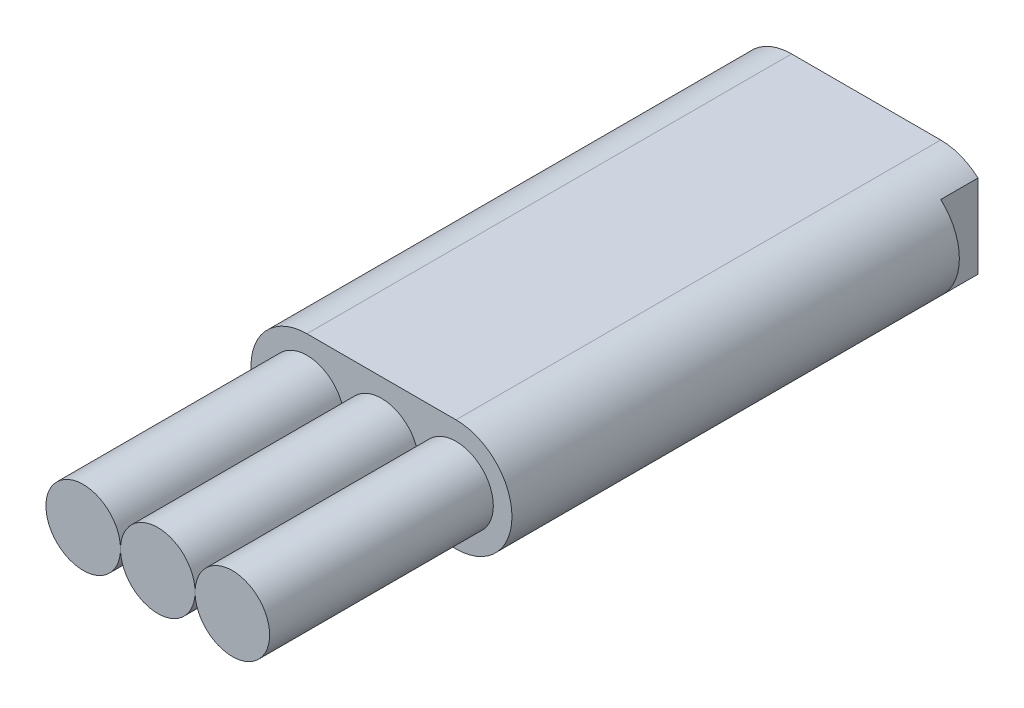
ISO-10303-21;
HEADER;
FILE_DESCRIPTION(('STEP AP214'),'2;1');
FILE_NAME('part.step','',(''),(''),'','','');
FILE_SCHEMA(('AUTOMOTIVE_DESIGN { 1 0 10303 214 1 1 1 1 }'));
ENDSEC;
DATA;
#1=APPLICATION_CONTEXT('core data for automotive mechanical design processes');
#2=APPLICATION_PROTOCOL_DEFINITION('international standard','automotive_design',2000,#1);
#3=PRODUCT_CONTEXT('',#1,'mechanical');
#4=PRODUCT('Part','Part','',(#3));
#5=PRODUCT_RELATED_PRODUCT_CATEGORY('part','',(#4));
#6=PRODUCT_DEFINITION_FORMATION('','',#4);
#7=PRODUCT_DEFINITION_CONTEXT('part definition',#1,'design');
#8=PRODUCT_DEFINITION('design','',#6,#7);
#9=PRODUCT_DEFINITION_SHAPE('','',#8);
#10=(LENGTH_UNIT() NAMED_UNIT(*) SI_UNIT(.MILLI.,.METRE.));
#11=(NAMED_UNIT(*) PLANE_ANGLE_UNIT() SI_UNIT($,.RADIAN.));
#12=(NAMED_UNIT(*) SI_UNIT($,.STERADIAN.) SOLID_ANGLE_UNIT());
#13=UNCERTAINTY_MEASURE_WITH_UNIT(LENGTH_MEASURE(1.E-05),#10,'distance_accuracy_value','');
#14=(GEOMETRIC_REPRESENTATION_CONTEXT(3) GLOBAL_UNCERTAINTY_ASSIGNED_CONTEXT((#13)) GLOBAL_UNIT_ASSIGNED_CONTEXT((#10,
#11,#12)) REPRESENTATION_CONTEXT('',''));
#15=CARTESIAN_POINT('',(0.,0.,0.));
#16=DIRECTION('',(0.,0.,1.));
#17=DIRECTION('',(1.,0.,0.));
#18=AXIS2_PLACEMENT_3D('',#15,#16,#17);
#19=CARTESIAN_POINT('',(2.,0.,-13.));
#20=DIRECTION('',(0.,0.,1.));
#21=DIRECTION('',(1.,0.,0.));
#22=AXIS2_PLACEMENT_3D('',#19,#20,#21);
#23=CYLINDRICAL_SURFACE('',#22,1.5);
#24=CARTESIAN_POINT('',(2.,0.,-13.));
#25=DIRECTION('',(0.,0.,-1.));
#26=DIRECTION('',(-1.,0.,0.));
#27=AXIS2_PLACEMENT_3D('',#24,#25,#26);
#28=CIRCLE('',#27,1.5);
#29=CARTESIAN_POINT('',(3.,-1.11803398874989,-13.));
#30=VERTEX_POINT('',#29);
#31=CARTESIAN_POINT('',(2.,-1.5,-13.));
#32=VERTEX_POINT('',#31);
#33=EDGE_CURVE('E137',#30,#32,#28,.T.);
#34=ORIENTED_EDGE('',*,*,#33,.F.);
#35=DIRECTION('',(0.,0.,1.));
#36=VECTOR('',#35,1.);
#37=CARTESIAN_POINT('',(3.,-1.11803398874989,-13.));
#38=LINE('',#37,#36);
#39=CARTESIAN_POINT('',(3.,-1.11803398874989,-12.));
#40=VERTEX_POINT('',#39);
#41=EDGE_CURVE('E69',#30,#40,#38,.T.);
#42=ORIENTED_EDGE('',*,*,#41,.T.);
#43=CARTESIAN_POINT('',(2.,0.,-12.));
#44=DIRECTION('',(0.,0.,1.));
#45=DIRECTION('',(1.,0.,0.));
#46=AXIS2_PLACEMENT_3D('',#43,#44,#45);
#47=CIRCLE('',#46,1.5);
#48=CARTESIAN_POINT('',(3.,1.11803398874989,-12.));
#49=VERTEX_POINT('',#48);
#50=EDGE_CURVE('E13',#40,#49,#47,.T.);
#51=ORIENTED_EDGE('',*,*,#50,.T.);
#52=DIRECTION('',(0.,0.,1.));
#53=VECTOR('',#52,1.);
#54=CARTESIAN_POINT('',(3.,1.11803398874989,-13.));
#55=LINE('',#54,#53);
#56=CARTESIAN_POINT('',(3.,1.11803398874989,-13.));
#57=VERTEX_POINT('',#56);
#58=EDGE_CURVE('E120',#49,#57,#55,.F.);
#59=ORIENTED_EDGE('',*,*,#58,.T.);
#60=CARTESIAN_POINT('',(2.,1.5,-13.));
#61=VERTEX_POINT('',#60);
#62=EDGE_CURVE('E129',#61,#57,#28,.T.);
#63=ORIENTED_EDGE('',*,*,#62,.F.);
#64=DIRECTION('',(0.,0.,1.));
#65=VECTOR('',#64,1.);
#66=CARTESIAN_POINT('',(2.,1.5,-13.));
#67=LINE('',#66,#65);
#68=CARTESIAN_POINT('',(2.,1.5,0.));
#69=VERTEX_POINT('',#68);
#70=EDGE_CURVE('E149',#61,#69,#67,.T.);
#71=ORIENTED_EDGE('',*,*,#70,.T.);
#72=CARTESIAN_POINT('',(2.,0.,0.));
#73=DIRECTION('',(0.,0.,-1.));
#74=DIRECTION('',(-1.,0.,0.));
#75=AXIS2_PLACEMENT_3D('',#72,#73,#74);
#76=CIRCLE('',#75,1.5);
#77=CARTESIAN_POINT('',(2.,-1.5,0.));
#78=VERTEX_POINT('',#77);
#79=EDGE_CURVE('E150',#69,#78,#76,.T.);
#80=ORIENTED_EDGE('',*,*,#79,.T.);
#81=DIRECTION('',(0.,0.,1.));
#82=VECTOR('',#81,1.);
#83=CARTESIAN_POINT('',(2.,-1.5,-13.));
#84=LINE('',#83,#82);
#85=EDGE_CURVE('E165',#32,#78,#84,.T.);
#86=ORIENTED_EDGE('',*,*,#85,.F.);
#87=EDGE_LOOP('',(#34,#42,#51,#59,#63,#71,#80,#86));
#88=FACE_BOUND('',#87,.T.);
#89=ADVANCED_FACE('F55',(#88),#23,.T.);
#90=CARTESIAN_POINT('',(2.,-1.5,-13.));
#91=DIRECTION('',(0.,1.,0.));
#92=DIRECTION('',(-1.,0.,0.));
#93=AXIS2_PLACEMENT_3D('',#90,#91,#92);
#94=PLANE('',#93);
#95=DIRECTION('',(-1.,0.,0.));
#96=VECTOR('',#95,1.);
#97=CARTESIAN_POINT('',(2.,-1.5,0.));
#98=LINE('',#97,#96);
#99=CARTESIAN_POINT('',(-2.,-1.5,0.));
#100=VERTEX_POINT('',#99);
#101=EDGE_CURVE('E153',#78,#100,#98,.T.);
#102=ORIENTED_EDGE('',*,*,#101,.T.);
#103=DIRECTION('',(0.,0.,1.));
#104=VECTOR('',#103,1.);
#105=CARTESIAN_POINT('',(-2.,-1.5,-13.));
#106=LINE('',#105,#104);
#107=CARTESIAN_POINT('',(-2.,-1.5,-13.));
#108=VERTEX_POINT('',#107);
#109=EDGE_CURVE('E162',#108,#100,#106,.T.);
#110=ORIENTED_EDGE('',*,*,#109,.F.);
#111=DIRECTION('',(-1.,0.,0.));
#112=VECTOR('',#111,1.);
#113=CARTESIAN_POINT('',(2.,-1.5,-13.));
#114=LINE('',#113,#112);
#115=EDGE_CURVE('E136',#32,#108,#114,.T.);
#116=ORIENTED_EDGE('',*,*,#115,.F.);
#117=ORIENTED_EDGE('',*,*,#85,.T.);
#118=EDGE_LOOP('',(#102,#110,#116,#117));
#119=FACE_BOUND('',#118,.T.);
#120=ADVANCED_FACE('F191',(#119),#94,.F.);
#121=CARTESIAN_POINT('',(-2.,0.,-13.));
#122=DIRECTION('',(0.,0.,1.));
#123=DIRECTION('',(1.,0.,0.));
#124=AXIS2_PLACEMENT_3D('',#121,#122,#123);
#125=CYLINDRICAL_SURFACE('',#124,1.5);
#126=CARTESIAN_POINT('',(-2.,0.,-13.));
#127=DIRECTION('',(0.,0.,-1.));
#128=DIRECTION('',(-1.,0.,0.));
#129=AXIS2_PLACEMENT_3D('',#126,#127,#128);
#130=CIRCLE('',#129,1.5);
#131=CARTESIAN_POINT('',(-3.,1.1180339887499,-13.));
#132=VERTEX_POINT('',#131);
#133=CARTESIAN_POINT('',(-2.,1.5,-13.));
#134=VERTEX_POINT('',#133);
#135=EDGE_CURVE('E139',#132,#134,#130,.T.);
#136=ORIENTED_EDGE('',*,*,#135,.F.);
#137=DIRECTION('',(0.,0.,1.));
#138=VECTOR('',#137,1.);
#139=CARTESIAN_POINT('',(-3.,1.11803398874989,-13.));
#140=LINE('',#139,#138);
#141=CARTESIAN_POINT('',(-3.,1.1180339887499,-12.));
#142=VERTEX_POINT('',#141);
#143=EDGE_CURVE('E77',#132,#142,#140,.T.);
#144=ORIENTED_EDGE('',*,*,#143,.T.);
#145=CARTESIAN_POINT('',(-2.,0.,-12.));
#146=DIRECTION('',(0.,0.,1.));
#147=DIRECTION('',(1.,0.,0.));
#148=AXIS2_PLACEMENT_3D('',#145,#146,#147);
#149=CIRCLE('',#148,1.5);
#150=CARTESIAN_POINT('',(-3.,-1.11803398874989,-12.));
#151=VERTEX_POINT('',#150);
#152=EDGE_CURVE('E125',#142,#151,#149,.T.);
#153=ORIENTED_EDGE('',*,*,#152,.T.);
#154=DIRECTION('',(0.,0.,1.));
#155=VECTOR('',#154,1.);
#156=CARTESIAN_POINT('',(-3.,-1.11803398874989,-13.));
#157=LINE('',#156,#155);
#158=CARTESIAN_POINT('',(-3.,-1.11803398874989,-13.));
#159=VERTEX_POINT('',#158);
#160=EDGE_CURVE('E176',#151,#159,#157,.F.);
#161=ORIENTED_EDGE('',*,*,#160,.T.);
#162=EDGE_CURVE('E145',#108,#159,#130,.T.);
#163=ORIENTED_EDGE('',*,*,#162,.F.);
#164=ORIENTED_EDGE('',*,*,#109,.T.);
#165=CARTESIAN_POINT('',(-2.,0.,0.));
#166=DIRECTION('',(0.,0.,-1.));
#167=DIRECTION('',(-1.,0.,0.));
#168=AXIS2_PLACEMENT_3D('',#165,#166,#167);
#169=CIRCLE('',#168,1.5);
#170=CARTESIAN_POINT('',(-2.,1.5,0.));
#171=VERTEX_POINT('',#170);
#172=EDGE_CURVE('E155',#100,#171,#169,.T.);
#173=ORIENTED_EDGE('',*,*,#172,.T.);
#174=DIRECTION('',(0.,0.,1.));
#175=VECTOR('',#174,1.);
#176=CARTESIAN_POINT('',(-2.,1.5,-13.));
#177=LINE('',#176,#175);
#178=EDGE_CURVE('E159',#134,#171,#177,.T.);
#179=ORIENTED_EDGE('',*,*,#178,.F.);
#180=EDGE_LOOP('',(#136,#144,#153,#161,#163,#164,#173,#179));
#181=FACE_BOUND('',#180,.T.);
#182=ADVANCED_FACE('F174',(#181),#125,.T.);
#183=CARTESIAN_POINT('',(2.,1.5,-13.));
#184=DIRECTION('',(0.,-1.,0.));
#185=DIRECTION('',(1.,0.,0.));
#186=AXIS2_PLACEMENT_3D('',#183,#184,#185);
#187=PLANE('',#186);
#188=DIRECTION('',(1.,0.,0.));
#189=VECTOR('',#188,1.);
#190=CARTESIAN_POINT('',(2.,1.5,0.));
#191=LINE('',#190,#189);
#192=EDGE_CURVE('E141',#171,#69,#191,.T.);
#193=ORIENTED_EDGE('',*,*,#192,.T.);
#194=ORIENTED_EDGE('',*,*,#70,.F.);
#195=DIRECTION('',(1.,0.,0.));
#196=VECTOR('',#195,1.);
#197=CARTESIAN_POINT('',(2.,1.5,-13.));
#198=LINE('',#197,#196);
#199=EDGE_CURVE('E134',#134,#61,#198,.T.);
#200=ORIENTED_EDGE('',*,*,#199,.F.);
#201=ORIENTED_EDGE('',*,*,#178,.T.);
#202=EDGE_LOOP('',(#193,#194,#200,#201));
#203=FACE_BOUND('',#202,.T.);
#204=ADVANCED_FACE('F196',(#203),#187,.F.);
#205=CARTESIAN_POINT('',(2.,0.,-13.));
#206=DIRECTION('',(0.,0.,-1.));
#207=DIRECTION('',(-1.,0.,0.));
#208=AXIS2_PLACEMENT_3D('',#205,#206,#207);
#209=PLANE('',#208);
#210=DIRECTION('',(0.,1.,0.));
#211=VECTOR('',#210,1.);
#212=CARTESIAN_POINT('',(3.,0.,-13.));
#213=LINE('',#212,#211);
#214=EDGE_CURVE('E62',#30,#57,#213,.T.);
#215=ORIENTED_EDGE('',*,*,#214,.F.);
#216=ORIENTED_EDGE('',*,*,#33,.T.);
#217=ORIENTED_EDGE('',*,*,#115,.T.);
#218=ORIENTED_EDGE('',*,*,#162,.T.);
#219=DIRECTION('',(0.,-1.,0.));
#220=VECTOR('',#219,1.);
#221=CARTESIAN_POINT('',(-3.,0.,-13.));
#222=LINE('',#221,#220);
#223=EDGE_CURVE('E168',#132,#159,#222,.T.);
#224=ORIENTED_EDGE('',*,*,#223,.F.);
#225=ORIENTED_EDGE('',*,*,#135,.T.);
#226=ORIENTED_EDGE('',*,*,#199,.T.);
#227=ORIENTED_EDGE('',*,*,#62,.T.);
#228=EDGE_LOOP('',(#215,#216,#217,#218,#224,#225,#226,#227));
#229=FACE_BOUND('',#228,.T.);
#230=ADVANCED_FACE('F132',(#229),#209,.T.);
#231=CARTESIAN_POINT('',(2.,0.,0.));
#232=DIRECTION('',(0.,0.,-1.));
#233=DIRECTION('',(-1.,0.,0.));
#234=AXIS2_PLACEMENT_3D('',#231,#232,#233);
#235=PLANE('',#234);
#236=ORIENTED_EDGE('',*,*,#79,.F.);
#237=ORIENTED_EDGE('',*,*,#192,.F.);
#238=ORIENTED_EDGE('',*,*,#172,.F.);
#239=ORIENTED_EDGE('',*,*,#101,.F.);
#240=EDGE_LOOP('',(#236,#237,#238,#239));
#241=FACE_BOUND('',#240,.T.);
#242=ADVANCED_FACE('F199',(#241),#235,.F.);
#243=CARTESIAN_POINT('',(0.,0.,-12.));
#244=DIRECTION('',(0.,0.,1.));
#245=DIRECTION('',(1.,0.,0.));
#246=AXIS2_PLACEMENT_3D('',#243,#244,#245);
#247=PLANE('',#246);
#248=DIRECTION('',(0.,-1.,0.));
#249=VECTOR('',#248,1.);
#250=CARTESIAN_POINT('',(-3.,3.03395071436796,-12.));
#251=LINE('',#250,#249);
#252=EDGE_CURVE('E180',#142,#151,#251,.T.);
#253=ORIENTED_EDGE('',*,*,#252,.T.);
#254=ORIENTED_EDGE('',*,*,#152,.F.);
#255=EDGE_LOOP('',(#253,#254));
#256=FACE_BOUND('',#255,.T.);
#257=ADVANCED_FACE('F179',(#256),#247,.F.);
#258=CARTESIAN_POINT('',(-3.,3.03395071436796,-12.));
#259=DIRECTION('',(1.,0.,0.));
#260=DIRECTION('',(0.,1.,0.));
#261=AXIS2_PLACEMENT_3D('',#258,#259,#260);
#262=PLANE('',#261);
#263=ORIENTED_EDGE('',*,*,#223,.T.);
#264=ORIENTED_EDGE('',*,*,#160,.F.);
#265=ORIENTED_EDGE('',*,*,#252,.F.);
#266=ORIENTED_EDGE('',*,*,#143,.F.);
#267=EDGE_LOOP('',(#263,#264,#265,#266));
#268=FACE_BOUND('',#267,.T.);
#269=ADVANCED_FACE('F181',(#268),#262,.F.);
#270=CARTESIAN_POINT('',(0.,0.,-12.));
#271=DIRECTION('',(0.,0.,1.));
#272=DIRECTION('',(1.,0.,0.));
#273=AXIS2_PLACEMENT_3D('',#270,#271,#272);
#274=PLANE('',#273);
#275=DIRECTION('',(0.,1.,0.));
#276=VECTOR('',#275,1.);
#277=CARTESIAN_POINT('',(3.,-2.38514206996854,-12.));
#278=LINE('',#277,#276);
#279=EDGE_CURVE('E130',#40,#49,#278,.T.);
#280=ORIENTED_EDGE('',*,*,#279,.T.);
#281=ORIENTED_EDGE('',*,*,#50,.F.);
#282=EDGE_LOOP('',(#280,#281));
#283=FACE_BOUND('',#282,.T.);
#284=ADVANCED_FACE('F186',(#283),#274,.F.);
#285=CARTESIAN_POINT('',(3.,-2.38514206996854,-12.));
#286=DIRECTION('',(-1.,0.,0.));
#287=DIRECTION('',(0.,0.,1.));
#288=AXIS2_PLACEMENT_3D('',#285,#286,#287);
#289=PLANE('',#288);
#290=ORIENTED_EDGE('',*,*,#214,.T.);
#291=ORIENTED_EDGE('',*,*,#58,.F.);
#292=ORIENTED_EDGE('',*,*,#279,.F.);
#293=ORIENTED_EDGE('',*,*,#41,.F.);
#294=EDGE_LOOP('',(#290,#291,#292,#293));
#295=FACE_BOUND('',#294,.T.);
#296=ADVANCED_FACE('F119',(#295),#289,.F.);
#297=CLOSED_SHELL('',(#89,#120,#182,#204,#230,#242,#257,#269,#284,#296));
#298=MANIFOLD_SOLID_BREP('B2',#297);
#299=CARTESIAN_POINT('',(2.,0.,6.));
#300=DIRECTION('',(0.,0.,-1.));
#301=DIRECTION('',(-1.,0.,0.));
#302=AXIS2_PLACEMENT_3D('',#299,#300,#301);
#303=CYLINDRICAL_SURFACE('',#302,0.999999999999999);
#304=CARTESIAN_POINT('',(2.,0.,6.));
#305=DIRECTION('',(0.,0.,1.));
#306=DIRECTION('',(1.,0.,0.));
#307=AXIS2_PLACEMENT_3D('',#304,#305,#306);
#308=CIRCLE('',#307,0.999999999999999);
#309=CARTESIAN_POINT('',(3.,0.,6.));
#310=VERTEX_POINT('',#309);
#311=EDGE_CURVE('E54',#310,#310,#308,.T.);
#312=ORIENTED_EDGE('',*,*,#311,.F.);
#313=EDGE_LOOP('',(#312));
#314=FACE_BOUND('',#313,.T.);
#315=CARTESIAN_POINT('',(2.,0.,0.));
#316=DIRECTION('',(0.,0.,1.));
#317=DIRECTION('',(1.,0.,0.));
#318=AXIS2_PLACEMENT_3D('',#315,#316,#317);
#319=CIRCLE('',#318,0.999999999999999);
#320=CARTESIAN_POINT('',(3.,0.,0.));
#321=VERTEX_POINT('',#320);
#322=EDGE_CURVE('E291',#321,#321,#319,.T.);
#323=ORIENTED_EDGE('',*,*,#322,.T.);
#324=EDGE_LOOP('',(#323));
#325=FACE_BOUND('',#324,.T.);
#326=ADVANCED_FACE('F288',(#314,#325),#303,.T.);
#327=CARTESIAN_POINT('',(0.,0.,6.));
#328=DIRECTION('',(0.,0.,1.));
#329=DIRECTION('',(1.,0.,0.));
#330=AXIS2_PLACEMENT_3D('',#327,#328,#329);
#331=PLANE('',#330);
#332=ORIENTED_EDGE('',*,*,#311,.T.);
#333=EDGE_LOOP('',(#332));
#334=FACE_BOUND('',#333,.T.);
#335=ADVANCED_FACE('F303',(#334),#331,.T.);
#336=CARTESIAN_POINT('',(0.,0.,0.));
#337=DIRECTION('',(0.,0.,1.));
#338=DIRECTION('',(1.,0.,0.));
#339=AXIS2_PLACEMENT_3D('',#336,#337,#338);
#340=PLANE('',#339);
#341=ORIENTED_EDGE('',*,*,#322,.F.);
#342=EDGE_LOOP('',(#341));
#343=FACE_BOUND('',#342,.T.);
#344=ADVANCED_FACE('F301',(#343),#340,.F.);
#345=CLOSED_SHELL('',(#326,#335,#344));
#346=MANIFOLD_SOLID_BREP('B7',#345);
#347=CARTESIAN_POINT('',(0.,0.,6.));
#348=DIRECTION('',(0.,0.,-1.));
#349=DIRECTION('',(-1.,0.,0.));
#350=AXIS2_PLACEMENT_3D('',#347,#348,#349);
#351=CYLINDRICAL_SURFACE('',#350,1.);
#352=CARTESIAN_POINT('',(0.,0.,6.));
#353=DIRECTION('',(0.,0.,1.));
#354=DIRECTION('',(1.,0.,0.));
#355=AXIS2_PLACEMENT_3D('',#352,#353,#354);
#356=CIRCLE('',#355,1.);
#357=CARTESIAN_POINT('',(1.,0.,6.));
#358=VERTEX_POINT('',#357);
#359=EDGE_CURVE('E287',#358,#358,#356,.T.);
#360=ORIENTED_EDGE('',*,*,#359,.F.);
#361=EDGE_LOOP('',(#360));
#362=FACE_BOUND('',#361,.T.);
#363=CARTESIAN_POINT('',(0.,0.,0.));
#364=DIRECTION('',(0.,0.,1.));
#365=DIRECTION('',(1.,0.,0.));
#366=AXIS2_PLACEMENT_3D('',#363,#364,#365);
#367=CIRCLE('',#366,1.);
#368=CARTESIAN_POINT('',(1.,0.,0.));
#369=VERTEX_POINT('',#368);
#370=EDGE_CURVE('E338',#369,#369,#367,.T.);
#371=ORIENTED_EDGE('',*,*,#370,.T.);
#372=EDGE_LOOP('',(#371));
#373=FACE_BOUND('',#372,.T.);
#374=ADVANCED_FACE('F335',(#362,#373),#351,.T.);
#375=CARTESIAN_POINT('',(0.,0.,6.));
#376=DIRECTION('',(0.,0.,1.));
#377=DIRECTION('',(1.,0.,0.));
#378=AXIS2_PLACEMENT_3D('',#375,#376,#377);
#379=PLANE('',#378);
#380=ORIENTED_EDGE('',*,*,#359,.T.);
#381=EDGE_LOOP('',(#380));
#382=FACE_BOUND('',#381,.T.);
#383=ADVANCED_FACE('F350',(#382),#379,.T.);
#384=CARTESIAN_POINT('',(0.,0.,0.));
#385=DIRECTION('',(0.,0.,1.));
#386=DIRECTION('',(1.,0.,0.));
#387=AXIS2_PLACEMENT_3D('',#384,#385,#386);
#388=PLANE('',#387);
#389=ORIENTED_EDGE('',*,*,#370,.F.);
#390=EDGE_LOOP('',(#389));
#391=FACE_BOUND('',#390,.T.);
#392=ADVANCED_FACE('F348',(#391),#388,.F.);
#393=CLOSED_SHELL('',(#374,#383,#392));
#394=MANIFOLD_SOLID_BREP('B49',#393);
#395=CARTESIAN_POINT('',(-2.,0.,6.));
#396=DIRECTION('',(0.,0.,-1.));
#397=DIRECTION('',(-1.,0.,0.));
#398=AXIS2_PLACEMENT_3D('',#395,#396,#397);
#399=CYLINDRICAL_SURFACE('',#398,1.);
#400=CARTESIAN_POINT('',(-2.,0.,6.));
#401=DIRECTION('',(0.,0.,1.));
#402=DIRECTION('',(1.,0.,0.));
#403=AXIS2_PLACEMENT_3D('',#400,#401,#402);
#404=CIRCLE('',#403,1.);
#405=CARTESIAN_POINT('',(-0.999999999999999,0.,6.));
#406=VERTEX_POINT('',#405);
#407=EDGE_CURVE('E334',#406,#406,#404,.T.);
#408=ORIENTED_EDGE('',*,*,#407,.F.);
#409=EDGE_LOOP('',(#408));
#410=FACE_BOUND('',#409,.T.);
#411=CARTESIAN_POINT('',(-2.,0.,0.));
#412=DIRECTION('',(0.,0.,1.));
#413=DIRECTION('',(1.,0.,0.));
#414=AXIS2_PLACEMENT_3D('',#411,#412,#413);
#415=CIRCLE('',#414,1.);
#416=CARTESIAN_POINT('',(-0.999999999999999,0.,0.));
#417=VERTEX_POINT('',#416);
#418=EDGE_CURVE('E378',#417,#417,#415,.T.);
#419=ORIENTED_EDGE('',*,*,#418,.T.);
#420=EDGE_LOOP('',(#419));
#421=FACE_BOUND('',#420,.T.);
#422=ADVANCED_FACE('F375',(#410,#421),#399,.T.);
#423=CARTESIAN_POINT('',(0.,0.,6.));
#424=DIRECTION('',(0.,0.,1.));
#425=DIRECTION('',(1.,0.,0.));
#426=AXIS2_PLACEMENT_3D('',#423,#424,#425);
#427=PLANE('',#426);
#428=ORIENTED_EDGE('',*,*,#407,.T.);
#429=EDGE_LOOP('',(#428));
#430=FACE_BOUND('',#429,.T.);
#431=ADVANCED_FACE('F390',(#430),#427,.T.);
#432=CARTESIAN_POINT('',(0.,0.,0.));
#433=DIRECTION('',(0.,0.,1.));
#434=DIRECTION('',(1.,0.,0.));
#435=AXIS2_PLACEMENT_3D('',#432,#433,#434);
#436=PLANE('',#435);
#437=ORIENTED_EDGE('',*,*,#418,.F.);
#438=EDGE_LOOP('',(#437));
#439=FACE_BOUND('',#438,.T.);
#440=ADVANCED_FACE('F388',(#439),#436,.F.);
#441=CLOSED_SHELL('',(#422,#431,#440));
#442=MANIFOLD_SOLID_BREP('B282',#441);
#443=ADVANCED_BREP_SHAPE_REPRESENTATION('',(#18,#298,#346,#394,#442),#14);
#444=SHAPE_DEFINITION_REPRESENTATION(#9,#443);
ENDSEC;
END-ISO-10303-21;
